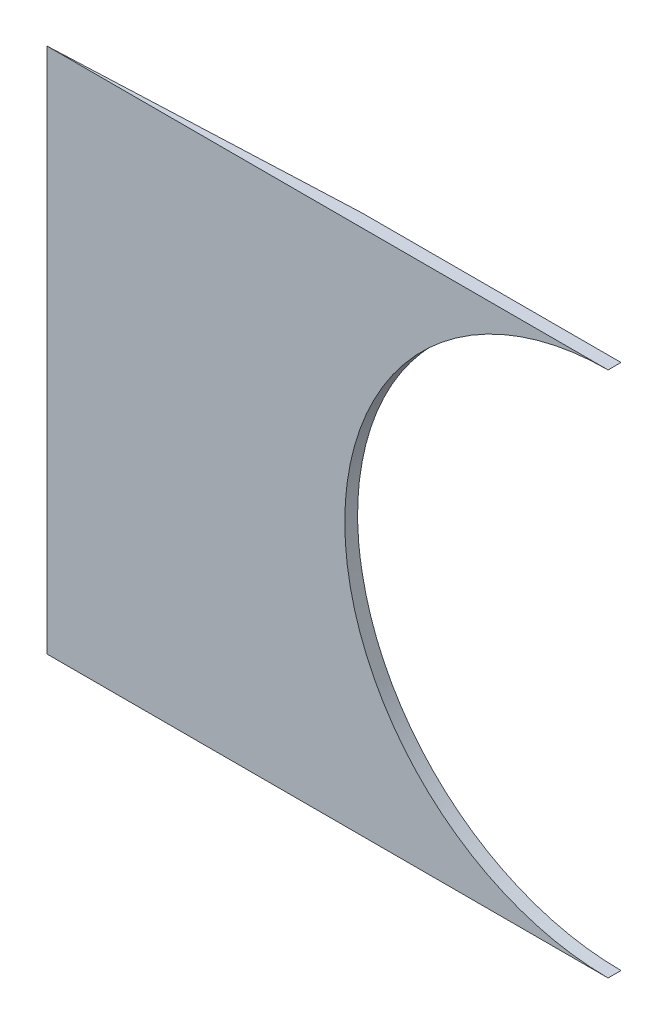
ISO-10303-21;
HEADER;
FILE_DESCRIPTION(('STEP AP214'),'2;1');
FILE_NAME('part.step','',(''),(''),'','','');
FILE_SCHEMA(('AUTOMOTIVE_DESIGN { 1 0 10303 214 1 1 1 1 }'));
ENDSEC;
DATA;
#1=APPLICATION_CONTEXT('core data for automotive mechanical design processes');
#2=APPLICATION_PROTOCOL_DEFINITION('international standard','automotive_design',2000,#1);
#3=PRODUCT_CONTEXT('',#1,'mechanical');
#4=PRODUCT('Part','Part','',(#3));
#5=PRODUCT_RELATED_PRODUCT_CATEGORY('part','',(#4));
#6=PRODUCT_DEFINITION_FORMATION('','',#4);
#7=PRODUCT_DEFINITION_CONTEXT('part definition',#1,'design');
#8=PRODUCT_DEFINITION('design','',#6,#7);
#9=PRODUCT_DEFINITION_SHAPE('','',#8);
#10=(LENGTH_UNIT() NAMED_UNIT(*) SI_UNIT(.MILLI.,.METRE.));
#11=(NAMED_UNIT(*) PLANE_ANGLE_UNIT() SI_UNIT($,.RADIAN.));
#12=(NAMED_UNIT(*) SI_UNIT($,.STERADIAN.) SOLID_ANGLE_UNIT());
#13=UNCERTAINTY_MEASURE_WITH_UNIT(LENGTH_MEASURE(1.E-05),#10,'distance_accuracy_value','');
#14=(GEOMETRIC_REPRESENTATION_CONTEXT(3) GLOBAL_UNCERTAINTY_ASSIGNED_CONTEXT((#13)) GLOBAL_UNIT_ASSIGNED_CONTEXT((#10,
#11,#12)) REPRESENTATION_CONTEXT('',''));
#15=CARTESIAN_POINT('',(0.,0.,0.));
#16=DIRECTION('',(0.,0.,1.));
#17=DIRECTION('',(1.,0.,0.));
#18=AXIS2_PLACEMENT_3D('',#15,#16,#17);
#19=CARTESIAN_POINT('',(0.,0.,0.));
#20=DIRECTION('',(0.,0.,1.));
#21=DIRECTION('',(1.,0.,0.));
#22=AXIS2_PLACEMENT_3D('',#19,#20,#21);
#23=PLANE('',#22);
#24=DIRECTION('',(1.,0.,0.));
#25=VECTOR('',#24,1.);
#26=CARTESIAN_POINT('',(-130.,-61.,0.));
#27=LINE('',#26,#25);
#28=CARTESIAN_POINT('',(-60.,-61.,0.));
#29=VERTEX_POINT('',#28);
#30=CARTESIAN_POINT('',(0.,-61.,0.));
#31=VERTEX_POINT('',#30);
#32=EDGE_CURVE('E82',#29,#31,#27,.T.);
#33=ORIENTED_EDGE('',*,*,#32,.F.);
#34=DIRECTION('',(0.,1.,0.));
#35=VECTOR('',#34,1.);
#36=CARTESIAN_POINT('',(-60.,0.,0.));
#37=LINE('',#36,#35);
#38=CARTESIAN_POINT('',(-60.,-11.0000000000001,0.));
#39=VERTEX_POINT('',#38);
#40=EDGE_CURVE('E11',#29,#39,#37,.T.);
#41=ORIENTED_EDGE('',*,*,#40,.T.);
#42=CARTESIAN_POINT('',(0.,0.,0.));
#43=DIRECTION('',(0.,0.,1.));
#44=DIRECTION('',(1.,0.,0.));
#45=AXIS2_PLACEMENT_3D('',#42,#43,#44);
#46=CIRCLE('',#45,61.);
#47=EDGE_CURVE('E89',#39,#31,#46,.T.);
#48=ORIENTED_EDGE('',*,*,#47,.T.);
#49=EDGE_LOOP('',(#33,#41,#48));
#50=FACE_BOUND('',#49,.T.);
#51=ADVANCED_FACE('F33',(#50),#23,.F.);
#52=CARTESIAN_POINT('',(0.,61.,3.));
#53=DIRECTION('',(0.,-1.,0.));
#54=DIRECTION('',(1.,0.,0.));
#55=AXIS2_PLACEMENT_3D('',#52,#53,#54);
#56=PLANE('',#55);
#57=DIRECTION('',(-1.,0.,0.));
#58=VECTOR('',#57,1.);
#59=CARTESIAN_POINT('',(0.,61.,0.));
#60=LINE('',#59,#58);
#61=CARTESIAN_POINT('',(0.,61.,0.));
#62=VERTEX_POINT('',#61);
#63=CARTESIAN_POINT('',(-60.,61.,0.));
#64=VERTEX_POINT('',#63);
#65=EDGE_CURVE('E70',#62,#64,#60,.T.);
#66=ORIENTED_EDGE('',*,*,#65,.T.);
#67=DIRECTION('',(-0.99908289581767,0.,0.0428178383921858));
#68=VECTOR('',#67,1.);
#69=CARTESIAN_POINT('',(-0.238337746995326,61.,-2.56121409655734));
#70=LINE('',#69,#68);
#71=CARTESIAN_POINT('',(-130.,61.,3.));
#72=VERTEX_POINT('',#71);
#73=EDGE_CURVE('E48',#64,#72,#70,.T.);
#74=ORIENTED_EDGE('',*,*,#73,.T.);
#75=DIRECTION('',(-1.,0.,0.));
#76=VECTOR('',#75,1.);
#77=CARTESIAN_POINT('',(0.,61.,3.));
#78=LINE('',#77,#76);
#79=CARTESIAN_POINT('',(0.,61.,3.));
#80=VERTEX_POINT('',#79);
#81=EDGE_CURVE('E72',#80,#72,#78,.T.);
#82=ORIENTED_EDGE('',*,*,#81,.F.);
#83=DIRECTION('',(0.,0.,-1.));
#84=VECTOR('',#83,1.);
#85=CARTESIAN_POINT('',(0.,61.,3.));
#86=LINE('',#85,#84);
#87=EDGE_CURVE('E57',#80,#62,#86,.T.);
#88=ORIENTED_EDGE('',*,*,#87,.T.);
#89=EDGE_LOOP('',(#66,#74,#82,#88));
#90=FACE_BOUND('',#89,.T.);
#91=ADVANCED_FACE('F35',(#90),#56,.F.);
#92=CARTESIAN_POINT('',(-130.,-61.,3.));
#93=DIRECTION('',(0.,1.,0.));
#94=DIRECTION('',(-1.,0.,0.));
#95=AXIS2_PLACEMENT_3D('',#92,#93,#94);
#96=PLANE('',#95);
#97=DIRECTION('',(1.,0.,0.));
#98=VECTOR('',#97,1.);
#99=CARTESIAN_POINT('',(-130.,-61.,3.));
#100=LINE('',#99,#98);
#101=CARTESIAN_POINT('',(-130.,-61.,3.));
#102=VERTEX_POINT('',#101);
#103=CARTESIAN_POINT('',(0.,-61.,3.));
#104=VERTEX_POINT('',#103);
#105=EDGE_CURVE('E103',#102,#104,#100,.T.);
#106=ORIENTED_EDGE('',*,*,#105,.F.);
#107=DIRECTION('',(-0.99908289581767,0.,0.0428178383921858));
#108=VECTOR('',#107,1.);
#109=CARTESIAN_POINT('',(-130.,-61.,3.));
#110=LINE('',#109,#108);
#111=EDGE_CURVE('E107',#29,#102,#110,.T.);
#112=ORIENTED_EDGE('',*,*,#111,.F.);
#113=ORIENTED_EDGE('',*,*,#32,.T.);
#114=DIRECTION('',(0.,0.,-1.));
#115=VECTOR('',#114,1.);
#116=CARTESIAN_POINT('',(0.,-61.,3.));
#117=LINE('',#116,#115);
#118=EDGE_CURVE('E74',#104,#31,#117,.T.);
#119=ORIENTED_EDGE('',*,*,#118,.F.);
#120=EDGE_LOOP('',(#106,#112,#113,#119));
#121=FACE_BOUND('',#120,.T.);
#122=ADVANCED_FACE('F100',(#121),#96,.F.);
#123=CARTESIAN_POINT('',(0.,0.,3.));
#124=DIRECTION('',(0.,0.,-1.));
#125=DIRECTION('',(-1.,0.,0.));
#126=AXIS2_PLACEMENT_3D('',#123,#124,#125);
#127=CYLINDRICAL_SURFACE('',#126,61.);
#128=CARTESIAN_POINT('',(0.,0.,-2.57142857142857));
#129=DIRECTION('',(0.0428178383921858,0.,0.99908289581767));
#130=DIRECTION('',(0.99908289581767,0.,-0.0428178383921858));
#131=AXIS2_PLACEMENT_3D('',#128,#129,#130);
#132=ELLIPSE('',#131,61.0559947081031,61.);
#133=CARTESIAN_POINT('',(-60.,11.0000000000001,0.));
#134=VERTEX_POINT('',#133);
#135=EDGE_CURVE('E88',#134,#39,#132,.T.);
#136=ORIENTED_EDGE('',*,*,#135,.F.);
#137=EDGE_CURVE('E81',#62,#134,#46,.T.);
#138=ORIENTED_EDGE('',*,*,#137,.F.);
#139=ORIENTED_EDGE('',*,*,#87,.F.);
#140=CARTESIAN_POINT('',(0.,0.,3.));
#141=DIRECTION('',(0.,0.,1.));
#142=DIRECTION('',(1.,0.,0.));
#143=AXIS2_PLACEMENT_3D('',#140,#141,#142);
#144=CIRCLE('',#143,61.);
#145=EDGE_CURVE('E75',#80,#104,#144,.T.);
#146=ORIENTED_EDGE('',*,*,#145,.T.);
#147=ORIENTED_EDGE('',*,*,#118,.T.);
#148=ORIENTED_EDGE('',*,*,#47,.F.);
#149=EDGE_LOOP('',(#136,#138,#139,#146,#147,#148));
#150=FACE_BOUND('',#149,.T.);
#151=ADVANCED_FACE('F85',(#150),#127,.F.);
#152=CARTESIAN_POINT('',(0.,0.,3.));
#153=DIRECTION('',(0.,0.,1.));
#154=DIRECTION('',(1.,0.,0.));
#155=AXIS2_PLACEMENT_3D('',#152,#153,#154);
#156=PLANE('',#155);
#157=ORIENTED_EDGE('',*,*,#81,.T.);
#158=DIRECTION('',(0.,-1.,0.));
#159=VECTOR('',#158,1.);
#160=CARTESIAN_POINT('',(-130.,61.,3.));
#161=LINE('',#160,#159);
#162=EDGE_CURVE('E91',#72,#102,#161,.T.);
#163=ORIENTED_EDGE('',*,*,#162,.T.);
#164=ORIENTED_EDGE('',*,*,#105,.T.);
#165=ORIENTED_EDGE('',*,*,#145,.F.);
#166=EDGE_LOOP('',(#157,#163,#164,#165));
#167=FACE_BOUND('',#166,.T.);
#168=ADVANCED_FACE('F119',(#167),#156,.T.);
#169=ORIENTED_EDGE('',*,*,#137,.T.);
#170=EDGE_CURVE('E37',#134,#64,#37,.T.);
#171=ORIENTED_EDGE('',*,*,#170,.T.);
#172=ORIENTED_EDGE('',*,*,#65,.F.);
#173=EDGE_LOOP('',(#169,#171,#172));
#174=FACE_BOUND('',#173,.T.);
#175=ADVANCED_FACE('F79',(#174),#23,.F.);
#176=CARTESIAN_POINT('',(-130.,61.9999999999999,3.));
#177=DIRECTION('',(0.0428178383921858,0.,0.99908289581767));
#178=DIRECTION('',(0.99908289581767,0.,-0.0428178383921858));
#179=AXIS2_PLACEMENT_3D('',#176,#177,#178);
#180=PLANE('',#179);
#181=ORIENTED_EDGE('',*,*,#170,.F.);
#182=ORIENTED_EDGE('',*,*,#135,.T.);
#183=ORIENTED_EDGE('',*,*,#40,.F.);
#184=ORIENTED_EDGE('',*,*,#111,.T.);
#185=ORIENTED_EDGE('',*,*,#162,.F.);
#186=ORIENTED_EDGE('',*,*,#73,.F.);
#187=EDGE_LOOP('',(#181,#182,#183,#184,#185,#186));
#188=FACE_BOUND('',#187,.T.);
#189=ADVANCED_FACE('F111',(#188),#180,.F.);
#190=CLOSED_SHELL('',(#51,#91,#122,#151,#168,#175,#189));
#191=MANIFOLD_SOLID_BREP('B2',#190);
#192=ADVANCED_BREP_SHAPE_REPRESENTATION('',(#18,#191),#14);
#193=SHAPE_DEFINITION_REPRESENTATION(#9,#192);
ENDSEC;
END-ISO-10303-21;
